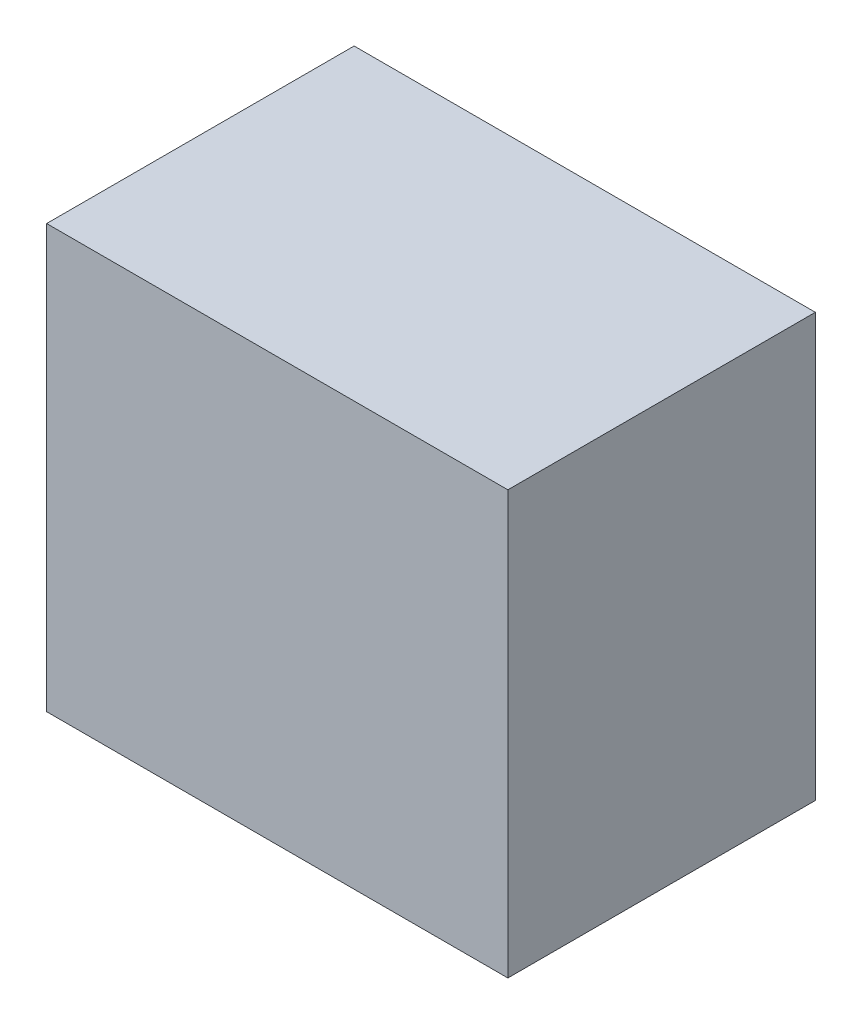
ISO-10303-21;
HEADER;
FILE_DESCRIPTION(('STEP AP214'),'2;1');
FILE_NAME('part.step','',(''),(''),'','','');
FILE_SCHEMA(('AUTOMOTIVE_DESIGN { 1 0 10303 214 1 1 1 1 }'));
ENDSEC;
DATA;
#1=APPLICATION_CONTEXT('core data for automotive mechanical design processes');
#2=APPLICATION_PROTOCOL_DEFINITION('international standard','automotive_design',2000,#1);
#3=PRODUCT_CONTEXT('',#1,'mechanical');
#4=PRODUCT('Part','Part','',(#3));
#5=PRODUCT_RELATED_PRODUCT_CATEGORY('part','',(#4));
#6=PRODUCT_DEFINITION_FORMATION('','',#4);
#7=PRODUCT_DEFINITION_CONTEXT('part definition',#1,'design');
#8=PRODUCT_DEFINITION('design','',#6,#7);
#9=PRODUCT_DEFINITION_SHAPE('','',#8);
#10=(LENGTH_UNIT() NAMED_UNIT(*) SI_UNIT(.MILLI.,.METRE.));
#11=(NAMED_UNIT(*) PLANE_ANGLE_UNIT() SI_UNIT($,.RADIAN.));
#12=(NAMED_UNIT(*) SI_UNIT($,.STERADIAN.) SOLID_ANGLE_UNIT());
#13=UNCERTAINTY_MEASURE_WITH_UNIT(LENGTH_MEASURE(1.E-05),#10,'distance_accuracy_value','');
#14=(GEOMETRIC_REPRESENTATION_CONTEXT(3) GLOBAL_UNCERTAINTY_ASSIGNED_CONTEXT((#13)) GLOBAL_UNIT_ASSIGNED_CONTEXT((#10,
#11,#12)) REPRESENTATION_CONTEXT('',''));
#15=CARTESIAN_POINT('',(0.,0.,0.));
#16=DIRECTION('',(0.,0.,1.));
#17=DIRECTION('',(1.,0.,0.));
#18=AXIS2_PLACEMENT_3D('',#15,#16,#17);
#19=CARTESIAN_POINT('',(-0.2999994,-0.27500072,0.3999992));
#20=DIRECTION('',(0.,0.,1.));
#21=DIRECTION('',(1.,0.,0.));
#22=AXIS2_PLACEMENT_3D('',#19,#20,#21);
#23=PLANE('',#22);
#24=DIRECTION('',(1.,0.,0.));
#25=VECTOR('',#24,1.);
#26=CARTESIAN_POINT('',(-0.2999994,0.27500072,0.3999992));
#27=LINE('',#26,#25);
#28=CARTESIAN_POINT('',(-0.2999994,0.27500072,0.3999992));
#29=VERTEX_POINT('',#28);
#30=CARTESIAN_POINT('',(0.2999994,0.27500072,0.3999992));
#31=VERTEX_POINT('',#30);
#32=EDGE_CURVE('E53',#29,#31,#27,.T.);
#33=ORIENTED_EDGE('',*,*,#32,.F.);
#34=DIRECTION('',(0.,1.,0.));
#35=VECTOR('',#34,1.);
#36=CARTESIAN_POINT('',(-0.2999994,-0.27500072,0.3999992));
#37=LINE('',#36,#35);
#38=CARTESIAN_POINT('',(-0.2999994,-0.27500072,0.3999992));
#39=VERTEX_POINT('',#38);
#40=EDGE_CURVE('E68',#39,#29,#37,.T.);
#41=ORIENTED_EDGE('',*,*,#40,.F.);
#42=DIRECTION('',(1.,0.,0.));
#43=VECTOR('',#42,1.);
#44=CARTESIAN_POINT('',(0.2999994,-0.27500072,0.3999992));
#45=LINE('',#44,#43);
#46=CARTESIAN_POINT('',(0.2999994,-0.27500072,0.3999992));
#47=VERTEX_POINT('',#46);
#48=EDGE_CURVE('E20',#47,#39,#45,.F.);
#49=ORIENTED_EDGE('',*,*,#48,.F.);
#50=DIRECTION('',(0.,1.,0.));
#51=VECTOR('',#50,1.);
#52=CARTESIAN_POINT('',(0.2999994,0.27500072,0.3999992));
#53=LINE('',#52,#51);
#54=EDGE_CURVE('E58',#31,#47,#53,.F.);
#55=ORIENTED_EDGE('',*,*,#54,.F.);
#56=EDGE_LOOP('',(#33,#41,#49,#55));
#57=FACE_BOUND('',#56,.T.);
#58=ADVANCED_FACE('F17',(#57),#23,.T.);
#59=CARTESIAN_POINT('',(0.2999994,-0.27500072,0.));
#60=DIRECTION('',(0.,-1.,0.));
#61=DIRECTION('',(0.,0.,-1.));
#62=AXIS2_PLACEMENT_3D('',#59,#60,#61);
#63=PLANE('',#62);
#64=DIRECTION('',(0.,0.,1.));
#65=VECTOR('',#64,1.);
#66=CARTESIAN_POINT('',(-0.2999994,-0.27500072,0.));
#67=LINE('',#66,#65);
#68=CARTESIAN_POINT('',(-0.2999994,-0.27500072,0.));
#69=VERTEX_POINT('',#68);
#70=EDGE_CURVE('E79',#69,#39,#67,.T.);
#71=ORIENTED_EDGE('',*,*,#70,.F.);
#72=DIRECTION('',(1.,0.,0.));
#73=VECTOR('',#72,1.);
#74=CARTESIAN_POINT('',(-0.2999994,-0.27500072,0.));
#75=LINE('',#74,#73);
#76=CARTESIAN_POINT('',(0.2999994,-0.27500072,0.));
#77=VERTEX_POINT('',#76);
#78=EDGE_CURVE('E74',#69,#77,#75,.T.);
#79=ORIENTED_EDGE('',*,*,#78,.T.);
#80=DIRECTION('',(0.,0.,-1.));
#81=VECTOR('',#80,1.);
#82=CARTESIAN_POINT('',(0.2999994,-0.27500072,0.));
#83=LINE('',#82,#81);
#84=EDGE_CURVE('E63',#47,#77,#83,.T.);
#85=ORIENTED_EDGE('',*,*,#84,.F.);
#86=ORIENTED_EDGE('',*,*,#48,.T.);
#87=EDGE_LOOP('',(#71,#79,#85,#86));
#88=FACE_BOUND('',#87,.T.);
#89=ADVANCED_FACE('F73',(#88),#63,.T.);
#90=CARTESIAN_POINT('',(0.2999994,0.27500072,0.));
#91=DIRECTION('',(1.,0.,0.));
#92=DIRECTION('',(0.,0.,-1.));
#93=AXIS2_PLACEMENT_3D('',#90,#91,#92);
#94=PLANE('',#93);
#95=ORIENTED_EDGE('',*,*,#84,.T.);
#96=DIRECTION('',(0.,1.,0.));
#97=VECTOR('',#96,1.);
#98=CARTESIAN_POINT('',(0.2999994,-0.27500072,0.));
#99=LINE('',#98,#97);
#100=CARTESIAN_POINT('',(0.2999994,0.27500072,0.));
#101=VERTEX_POINT('',#100);
#102=EDGE_CURVE('E84',#77,#101,#99,.T.);
#103=ORIENTED_EDGE('',*,*,#102,.T.);
#104=DIRECTION('',(0.,0.,1.));
#105=VECTOR('',#104,1.);
#106=CARTESIAN_POINT('',(0.2999994,0.27500072,0.));
#107=LINE('',#106,#105);
#108=EDGE_CURVE('E65',#31,#101,#107,.F.);
#109=ORIENTED_EDGE('',*,*,#108,.F.);
#110=ORIENTED_EDGE('',*,*,#54,.T.);
#111=EDGE_LOOP('',(#95,#103,#109,#110));
#112=FACE_BOUND('',#111,.T.);
#113=ADVANCED_FACE('F60',(#112),#94,.T.);
#114=CARTESIAN_POINT('',(-0.2999994,0.27500072,0.));
#115=DIRECTION('',(0.,1.,0.));
#116=DIRECTION('',(0.,0.,1.));
#117=AXIS2_PLACEMENT_3D('',#114,#115,#116);
#118=PLANE('',#117);
#119=ORIENTED_EDGE('',*,*,#108,.T.);
#120=DIRECTION('',(1.,0.,0.));
#121=VECTOR('',#120,1.);
#122=CARTESIAN_POINT('',(-0.2999994,0.27500072,0.));
#123=LINE('',#122,#121);
#124=CARTESIAN_POINT('',(-0.2999994,0.27500072,0.));
#125=VERTEX_POINT('',#124);
#126=EDGE_CURVE('E26',#101,#125,#123,.F.);
#127=ORIENTED_EDGE('',*,*,#126,.T.);
#128=DIRECTION('',(0.,0.,1.));
#129=VECTOR('',#128,1.);
#130=CARTESIAN_POINT('',(-0.2999994,0.27500072,0.));
#131=LINE('',#130,#129);
#132=EDGE_CURVE('E34',#29,#125,#131,.F.);
#133=ORIENTED_EDGE('',*,*,#132,.F.);
#134=ORIENTED_EDGE('',*,*,#32,.T.);
#135=EDGE_LOOP('',(#119,#127,#133,#134));
#136=FACE_BOUND('',#135,.T.);
#137=ADVANCED_FACE('F88',(#136),#118,.T.);
#138=CARTESIAN_POINT('',(-0.2999994,-0.27500072,0.));
#139=DIRECTION('',(-1.,0.,0.));
#140=DIRECTION('',(0.,0.,1.));
#141=AXIS2_PLACEMENT_3D('',#138,#139,#140);
#142=PLANE('',#141);
#143=ORIENTED_EDGE('',*,*,#132,.T.);
#144=DIRECTION('',(0.,1.,0.));
#145=VECTOR('',#144,1.);
#146=CARTESIAN_POINT('',(-0.2999994,-0.27500072,0.));
#147=LINE('',#146,#145);
#148=EDGE_CURVE('E11',#125,#69,#147,.F.);
#149=ORIENTED_EDGE('',*,*,#148,.T.);
#150=ORIENTED_EDGE('',*,*,#70,.T.);
#151=ORIENTED_EDGE('',*,*,#40,.T.);
#152=EDGE_LOOP('',(#143,#149,#150,#151));
#153=FACE_BOUND('',#152,.T.);
#154=ADVANCED_FACE('F91',(#153),#142,.T.);
#155=CARTESIAN_POINT('',(-0.2999994,-0.27500072,0.));
#156=DIRECTION('',(0.,0.,1.));
#157=DIRECTION('',(1.,0.,0.));
#158=AXIS2_PLACEMENT_3D('',#155,#156,#157);
#159=PLANE('',#158);
#160=ORIENTED_EDGE('',*,*,#126,.F.);
#161=ORIENTED_EDGE('',*,*,#102,.F.);
#162=ORIENTED_EDGE('',*,*,#78,.F.);
#163=ORIENTED_EDGE('',*,*,#148,.F.);
#164=EDGE_LOOP('',(#160,#161,#162,#163));
#165=FACE_BOUND('',#164,.T.);
#166=ADVANCED_FACE('F90',(#165),#159,.F.);
#167=CLOSED_SHELL('',(#58,#89,#113,#137,#154,#166));
#168=MANIFOLD_SOLID_BREP('B1',#167);
#169=ADVANCED_BREP_SHAPE_REPRESENTATION('',(#18,#168),#14);
#170=SHAPE_DEFINITION_REPRESENTATION(#9,#169);
ENDSEC;
END-ISO-10303-21;
